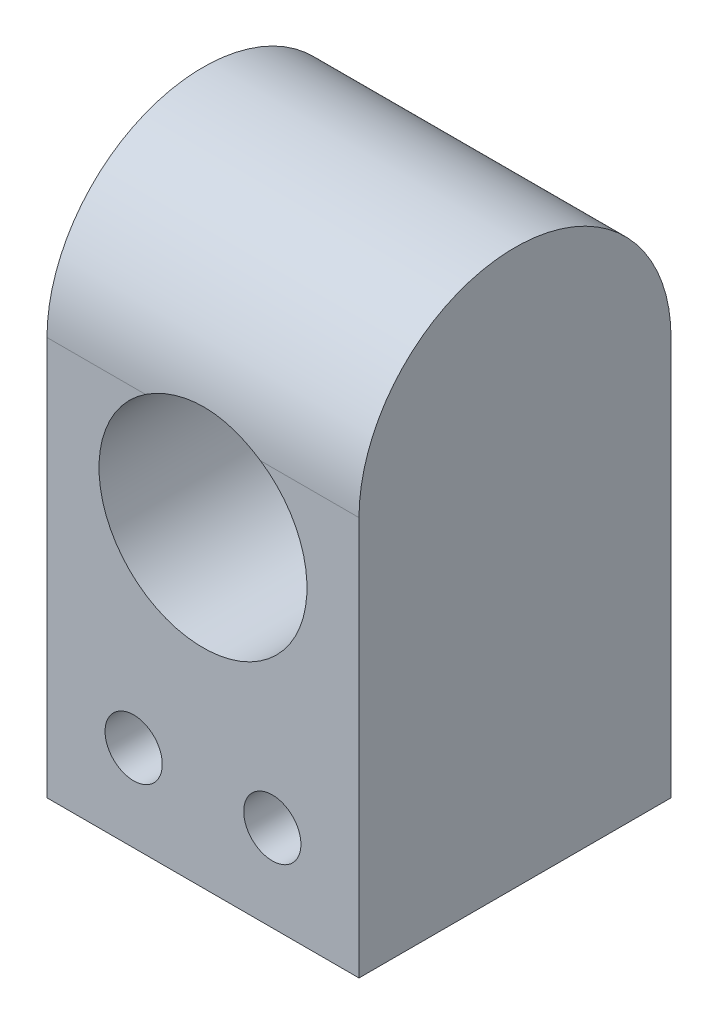
ISO-10303-21;
HEADER;
FILE_DESCRIPTION(('STEP AP214'),'2;1');
FILE_NAME('part.step','',(''),(''),'','','');
FILE_SCHEMA(('AUTOMOTIVE_DESIGN { 1 0 10303 214 1 1 1 1 }'));
ENDSEC;
DATA;
#1=APPLICATION_CONTEXT('core data for automotive mechanical design processes');
#2=APPLICATION_PROTOCOL_DEFINITION('international standard','automotive_design',2000,#1);
#3=PRODUCT_CONTEXT('',#1,'mechanical');
#4=PRODUCT('Part','Part','',(#3));
#5=PRODUCT_RELATED_PRODUCT_CATEGORY('part','',(#4));
#6=PRODUCT_DEFINITION_FORMATION('','',#4);
#7=PRODUCT_DEFINITION_CONTEXT('part definition',#1,'design');
#8=PRODUCT_DEFINITION('design','',#6,#7);
#9=PRODUCT_DEFINITION_SHAPE('','',#8);
#10=(LENGTH_UNIT() NAMED_UNIT(*) SI_UNIT(.MILLI.,.METRE.));
#11=(NAMED_UNIT(*) PLANE_ANGLE_UNIT() SI_UNIT($,.RADIAN.));
#12=(NAMED_UNIT(*) SI_UNIT($,.STERADIAN.) SOLID_ANGLE_UNIT());
#13=UNCERTAINTY_MEASURE_WITH_UNIT(LENGTH_MEASURE(1.E-05),#10,'distance_accuracy_value','');
#14=(GEOMETRIC_REPRESENTATION_CONTEXT(3) GLOBAL_UNCERTAINTY_ASSIGNED_CONTEXT((#13)) GLOBAL_UNIT_ASSIGNED_CONTEXT((#10,
#11,#12)) REPRESENTATION_CONTEXT('',''));
#15=CARTESIAN_POINT('',(0.,0.,0.));
#16=DIRECTION('',(0.,0.,1.));
#17=DIRECTION('',(1.,0.,0.));
#18=AXIS2_PLACEMENT_3D('',#15,#16,#17);
#19=CARTESIAN_POINT('',(18.,11.5,0.));
#20=DIRECTION('',(-1.,0.,0.));
#21=DIRECTION('',(0.,0.,1.));
#22=AXIS2_PLACEMENT_3D('',#19,#20,#21);
#23=CYLINDRICAL_SURFACE('',#22,9.);
#24=DIRECTION('',(-1.,0.,0.));
#25=VECTOR('',#24,1.);
#26=CARTESIAN_POINT('',(18.,11.5,-9.));
#27=LINE('',#26,#25);
#28=CARTESIAN_POINT('',(18.,11.5,-9.));
#29=VERTEX_POINT('',#28);
#30=CARTESIAN_POINT('',(12.3166247903554,11.5,-9.));
#31=VERTEX_POINT('',#30);
#32=EDGE_CURVE('E97',#29,#31,#27,.T.);
#33=ORIENTED_EDGE('',*,*,#32,.T.);
#34=CARTESIAN_POINT('',(12.3166247903554,11.5,-9.));
#35=CARTESIAN_POINT('',(12.1761745481952,11.5931857247578,-8.99998280686404));
#36=CARTESIAN_POINT('',(12.0317922057003,11.6804145747351,-8.99855170663781));
#37=CARTESIAN_POINT('',(11.7362436576243,11.8424064487936,-8.99385386357663));
#38=CARTESIAN_POINT('',(11.5850782346934,11.91717090638,-8.99058733202013));
#39=CARTESIAN_POINT('',(11.2770934608133,12.0536670923257,-8.98321231082458));
#40=CARTESIAN_POINT('',(11.1202771782546,12.1154057724005,-8.97910427260755));
#41=CARTESIAN_POINT('',(10.8020081921265,12.2254794431933,-8.97088254766373));
#42=CARTESIAN_POINT('',(10.6405554727502,12.273814388208,-8.96676886091772));
#43=CARTESIAN_POINT('',(10.3140870773853,12.3567525543189,-8.95922487573958));
#44=CARTESIAN_POINT('',(10.1490702362471,12.3913512109803,-8.9557948046545));
#45=CARTESIAN_POINT('',(9.8166910491816,12.4465448254244,-8.9501298620152));
#46=CARTESIAN_POINT('',(9.64932872217379,12.467139896099,-8.94789498082582));
#47=CARTESIAN_POINT('',(9.3134734590279,12.4941732408613,-8.94493181592674));
#48=CARTESIAN_POINT('',(9.1449806785411,12.5006134253665,-8.94420332890699));
#49=CARTESIAN_POINT('',(8.80805607207803,12.4992946764997,-8.94435076543655));
#50=CARTESIAN_POINT('',(8.63962424450806,12.4915361459604,-8.94522664346831));
#51=CARTESIAN_POINT('',(8.30449927814603,12.4619204707792,-8.94845959650483));
#52=CARTESIAN_POINT('',(8.13780257444923,12.440103168163,-8.95081248523224));
#53=CARTESIAN_POINT('',(7.80683097987093,12.3825644146765,-8.95666871348));
#54=CARTESIAN_POINT('',(7.64255632608802,12.34684161183,-8.9601721648598));
#55=CARTESIAN_POINT('',(7.3176976840931,12.2617734790637,-8.96780478435024));
#56=CARTESIAN_POINT('',(7.15711147776076,12.2124365816245,-8.97193356442457));
#57=CARTESIAN_POINT('',(6.8406941967366,12.1004958667899,-8.98011947678595));
#58=CARTESIAN_POINT('',(6.68486141124776,12.0378968885496,-8.98417663462359));
#59=CARTESIAN_POINT('',(6.38435800328011,11.9022785484094,-8.99125312525322));
#60=CARTESIAN_POINT('',(6.23948755800411,11.8297033713637,-8.99430395361245));
#61=CARTESIAN_POINT('',(5.95634049468018,11.6732289771663,-8.99866854537321));
#62=CARTESIAN_POINT('',(5.81805158792701,11.5893520824616,-8.99998567918921));
#63=CARTESIAN_POINT('',(5.6833752096446,11.5,-9.));
#64=B_SPLINE_CURVE_WITH_KNOTS('',3,(#34,#35,#36,#37,#38,#39,#40,#41,#42,#43,#44,#45,#46,#47,#48,
#49,#50,#51,#52,#53,#54,#55,#56,#57,#58,#59,#60,#61,#62,#63),.UNSPECIFIED.,.F.,.F.,(4,2,2,2,2,2,
2,2,2,2,2,2,2,2,4),(0.,0.505478352133196,1.01089853003349,1.5160482845355,2.02119976144932,
2.52651895507016,3.03183407494048,3.53708099064755,4.04231357217975,4.54612060348861,
5.04997663018364,5.55352126960013,6.05688248782416,6.54253134219247,7.02723466241762),.UNSPECIFIED.);
#65=CARTESIAN_POINT('',(5.6833752096446,11.5,-9.));
#66=VERTEX_POINT('',#65);
#67=EDGE_CURVE('E59',#31,#66,#64,.T.);
#68=ORIENTED_EDGE('',*,*,#67,.T.);
#69=CARTESIAN_POINT('',(0.,11.5,-9.));
#70=VERTEX_POINT('',#69);
#71=EDGE_CURVE('E94',#66,#70,#27,.T.);
#72=ORIENTED_EDGE('',*,*,#71,.T.);
#73=CARTESIAN_POINT('',(0.,11.5,0.));
#74=DIRECTION('',(1.,0.,0.));
#75=DIRECTION('',(0.,0.,1.));
#76=AXIS2_PLACEMENT_3D('',#73,#74,#75);
#77=CIRCLE('',#76,9.);
#78=CARTESIAN_POINT('',(0.,11.5,9.));
#79=VERTEX_POINT('',#78);
#80=EDGE_CURVE('E98',#70,#79,#77,.T.);
#81=ORIENTED_EDGE('',*,*,#80,.T.);
#82=DIRECTION('',(-1.,0.,0.));
#83=VECTOR('',#82,1.);
#84=CARTESIAN_POINT('',(18.,11.5,9.));
#85=LINE('',#84,#83);
#86=CARTESIAN_POINT('',(5.6833752096446,11.5,9.));
#87=VERTEX_POINT('',#86);
#88=EDGE_CURVE('E116',#87,#79,#85,.T.);
#89=ORIENTED_EDGE('',*,*,#88,.F.);
#90=CARTESIAN_POINT('',(5.6833752096446,11.5,9.));
#91=CARTESIAN_POINT('',(5.82382545180477,11.5931857247578,8.99998280686404));
#92=CARTESIAN_POINT('',(5.96820779429973,11.6804145747351,8.99855170663781));
#93=CARTESIAN_POINT('',(6.2637563423757,11.8424064487936,8.99385386357663));
#94=CARTESIAN_POINT('',(6.41492176530659,11.91717090638,8.99058733202014));
#95=CARTESIAN_POINT('',(6.72290653918665,12.0536670923257,8.98321231082459));
#96=CARTESIAN_POINT('',(6.87972282174541,12.1154057724005,8.97910427260756));
#97=CARTESIAN_POINT('',(7.19799180787347,12.2254794431933,8.97088254766373));
#98=CARTESIAN_POINT('',(7.35944452724977,12.273814388208,8.96676886091773));
#99=CARTESIAN_POINT('',(7.68591292261471,12.3567525543189,8.95922487573958));
#100=CARTESIAN_POINT('',(7.85092976375287,12.3913512109803,8.9557948046545));
#101=CARTESIAN_POINT('',(8.1833089508184,12.4465448254244,8.9501298620152));
#102=CARTESIAN_POINT('',(8.3506712778262,12.467139896099,8.94789498082582));
#103=CARTESIAN_POINT('',(8.68652654097209,12.4941732408613,8.94493181592675));
#104=CARTESIAN_POINT('',(8.85501932145889,12.5006134253665,8.94420332890699));
#105=CARTESIAN_POINT('',(9.19194392792196,12.4992946764997,8.94435076543656));
#106=CARTESIAN_POINT('',(9.36037575549194,12.4915361459604,8.94522664346831));
#107=CARTESIAN_POINT('',(9.69550072185396,12.4619204707792,8.94845959650483));
#108=CARTESIAN_POINT('',(9.86219742555076,12.440103168163,8.95081248523224));
#109=CARTESIAN_POINT('',(10.1931690201291,12.3825644146765,8.95666871348001));
#110=CARTESIAN_POINT('',(10.357443673912,12.34684161183,8.9601721648598));
#111=CARTESIAN_POINT('',(10.6823023159069,12.2617734790637,8.96780478435024));
#112=CARTESIAN_POINT('',(10.8428885222392,12.2124365816245,8.97193356442458));
#113=CARTESIAN_POINT('',(11.1593058032634,12.1004958667899,8.98011947678595));
#114=CARTESIAN_POINT('',(11.3151385887522,12.0378968885496,8.98417663462359));
#115=CARTESIAN_POINT('',(11.6156419967199,11.9022785484094,8.99125312525322));
#116=CARTESIAN_POINT('',(11.7605124419959,11.8297033713637,8.99430395361245));
#117=CARTESIAN_POINT('',(12.0436595053198,11.6732289771663,8.99866854537321));
#118=CARTESIAN_POINT('',(12.181948412073,11.5893520824616,8.99998567918922));
#119=CARTESIAN_POINT('',(12.3166247903554,11.5,9.));
#120=B_SPLINE_CURVE_WITH_KNOTS('',3,(#90,#91,#92,#93,#94,#95,#96,#97,#98,#99,#100,#101,#102,
#103,#104,#105,#106,#107,#108,#109,#110,#111,#112,#113,#114,#115,#116,#117,#118,#119),
.UNSPECIFIED.,.F.,.F.,(4,2,2,2,2,2,2,2,2,2,2,2,2,2,4),(0.,0.505478352133195,1.01089853003349,
1.5160482845355,2.02119976144932,2.52651895507016,3.03183407494048,3.53708099064754,
4.04231357217974,4.54612060348861,5.04997663018364,5.55352126960013,6.05688248782415,
6.54253134219247,7.02723466241762),.UNSPECIFIED.);
#121=CARTESIAN_POINT('',(12.3166247903554,11.5,9.));
#122=VERTEX_POINT('',#121);
#123=EDGE_CURVE('E52',#87,#122,#120,.T.);
#124=ORIENTED_EDGE('',*,*,#123,.T.);
#125=CARTESIAN_POINT('',(18.,11.5,9.));
#126=VERTEX_POINT('',#125);
#127=EDGE_CURVE('E46',#126,#122,#85,.T.);
#128=ORIENTED_EDGE('',*,*,#127,.F.);
#129=CARTESIAN_POINT('',(18.,11.5,0.));
#130=DIRECTION('',(1.,0.,0.));
#131=DIRECTION('',(0.,0.,1.));
#132=AXIS2_PLACEMENT_3D('',#129,#130,#131);
#133=CIRCLE('',#132,9.);
#134=EDGE_CURVE('E135',#29,#126,#133,.T.);
#135=ORIENTED_EDGE('',*,*,#134,.F.);
#136=EDGE_LOOP('',(#33,#68,#72,#81,#89,#124,#128,#135));
#137=FACE_BOUND('',#136,.T.);
#138=ADVANCED_FACE('F38',(#137),#23,.T.);
#139=CARTESIAN_POINT('',(18.,-11.5,9.));
#140=DIRECTION('',(0.,0.,-1.));
#141=DIRECTION('',(-1.,0.,0.));
#142=AXIS2_PLACEMENT_3D('',#139,#140,#141);
#143=PLANE('',#142);
#144=CARTESIAN_POINT('',(5.,-6.5,9.));
#145=DIRECTION('',(0.,0.,1.));
#146=DIRECTION('',(1.,0.,0.));
#147=AXIS2_PLACEMENT_3D('',#144,#145,#146);
#148=CIRCLE('',#147,1.64999999999999);
#149=CARTESIAN_POINT('',(6.64999999999999,-6.5,9.));
#150=VERTEX_POINT('',#149);
#151=EDGE_CURVE('E181',#150,#150,#148,.T.);
#152=ORIENTED_EDGE('',*,*,#151,.F.);
#153=EDGE_LOOP('',(#152));
#154=FACE_BOUND('',#153,.T.);
#155=CARTESIAN_POINT('',(13.,-6.5,9.));
#156=DIRECTION('',(0.,0.,1.));
#157=DIRECTION('',(1.,0.,0.));
#158=AXIS2_PLACEMENT_3D('',#155,#156,#157);
#159=CIRCLE('',#158,1.64999999999999);
#160=CARTESIAN_POINT('',(14.65,-6.5,9.));
#161=VERTEX_POINT('',#160);
#162=EDGE_CURVE('E184',#161,#161,#159,.T.);
#163=ORIENTED_EDGE('',*,*,#162,.F.);
#164=EDGE_LOOP('',(#163));
#165=FACE_BOUND('',#164,.T.);
#166=ORIENTED_EDGE('',*,*,#127,.T.);
#167=CARTESIAN_POINT('',(9.,6.5,9.));
#168=DIRECTION('',(0.,0.,1.));
#169=DIRECTION('',(1.,0.,0.));
#170=AXIS2_PLACEMENT_3D('',#167,#168,#169);
#171=CIRCLE('',#170,6.);
#172=EDGE_CURVE('E125',#87,#122,#171,.T.);
#173=ORIENTED_EDGE('',*,*,#172,.F.);
#174=ORIENTED_EDGE('',*,*,#88,.T.);
#175=DIRECTION('',(0.,-1.,0.));
#176=VECTOR('',#175,1.);
#177=CARTESIAN_POINT('',(0.,-11.5,9.));
#178=LINE('',#177,#176);
#179=CARTESIAN_POINT('',(0.,-11.5,9.));
#180=VERTEX_POINT('',#179);
#181=EDGE_CURVE('E124',#79,#180,#178,.T.);
#182=ORIENTED_EDGE('',*,*,#181,.T.);
#183=DIRECTION('',(-1.,0.,0.));
#184=VECTOR('',#183,1.);
#185=CARTESIAN_POINT('',(18.,-11.5,9.));
#186=LINE('',#185,#184);
#187=CARTESIAN_POINT('',(18.,-11.5,9.));
#188=VERTEX_POINT('',#187);
#189=EDGE_CURVE('E114',#188,#180,#186,.T.);
#190=ORIENTED_EDGE('',*,*,#189,.F.);
#191=DIRECTION('',(0.,-1.,0.));
#192=VECTOR('',#191,1.);
#193=CARTESIAN_POINT('',(18.,-11.5,9.));
#194=LINE('',#193,#192);
#195=EDGE_CURVE('E137',#126,#188,#194,.T.);
#196=ORIENTED_EDGE('',*,*,#195,.F.);
#197=EDGE_LOOP('',(#166,#173,#174,#182,#190,#196));
#198=FACE_BOUND('',#197,.T.);
#199=ADVANCED_FACE('F122',(#154,#165,#198),#143,.F.);
#200=CARTESIAN_POINT('',(18.,-11.5,9.));
#201=DIRECTION('',(0.,1.,0.));
#202=DIRECTION('',(0.,0.,1.));
#203=AXIS2_PLACEMENT_3D('',#200,#201,#202);
#204=PLANE('',#203);
#205=DIRECTION('',(0.,0.,-1.));
#206=VECTOR('',#205,1.);
#207=CARTESIAN_POINT('',(0.,-11.5,9.));
#208=LINE('',#207,#206);
#209=CARTESIAN_POINT('',(0.,-11.5,-9.));
#210=VERTEX_POINT('',#209);
#211=EDGE_CURVE('E129',#180,#210,#208,.T.);
#212=ORIENTED_EDGE('',*,*,#211,.T.);
#213=DIRECTION('',(-1.,0.,0.));
#214=VECTOR('',#213,1.);
#215=CARTESIAN_POINT('',(18.,-11.5,-9.));
#216=LINE('',#215,#214);
#217=CARTESIAN_POINT('',(18.,-11.5,-9.));
#218=VERTEX_POINT('',#217);
#219=EDGE_CURVE('E107',#218,#210,#216,.T.);
#220=ORIENTED_EDGE('',*,*,#219,.F.);
#221=DIRECTION('',(0.,0.,-1.));
#222=VECTOR('',#221,1.);
#223=CARTESIAN_POINT('',(18.,-11.5,9.));
#224=LINE('',#223,#222);
#225=EDGE_CURVE('E108',#188,#218,#224,.T.);
#226=ORIENTED_EDGE('',*,*,#225,.F.);
#227=ORIENTED_EDGE('',*,*,#189,.T.);
#228=EDGE_LOOP('',(#212,#220,#226,#227));
#229=FACE_BOUND('',#228,.T.);
#230=ADVANCED_FACE('F150',(#229),#204,.F.);
#231=CARTESIAN_POINT('',(18.,-11.5,-9.));
#232=DIRECTION('',(0.,0.,1.));
#233=DIRECTION('',(1.,0.,0.));
#234=AXIS2_PLACEMENT_3D('',#231,#232,#233);
#235=PLANE('',#234);
#236=CARTESIAN_POINT('',(5.,-6.5,-9.));
#237=DIRECTION('',(0.,0.,1.));
#238=DIRECTION('',(1.,0.,0.));
#239=AXIS2_PLACEMENT_3D('',#236,#237,#238);
#240=CIRCLE('',#239,1.64999999999998);
#241=CARTESIAN_POINT('',(6.64999999999999,-6.5,-9.));
#242=VERTEX_POINT('',#241);
#243=EDGE_CURVE('E186',#242,#242,#240,.T.);
#244=ORIENTED_EDGE('',*,*,#243,.T.);
#245=EDGE_LOOP('',(#244));
#246=FACE_BOUND('',#245,.T.);
#247=CARTESIAN_POINT('',(13.,-6.5,-9.));
#248=DIRECTION('',(0.,0.,1.));
#249=DIRECTION('',(1.,0.,0.));
#250=AXIS2_PLACEMENT_3D('',#247,#248,#249);
#251=CIRCLE('',#250,1.64999999999998);
#252=CARTESIAN_POINT('',(14.65,-6.5,-9.));
#253=VERTEX_POINT('',#252);
#254=EDGE_CURVE('E151',#253,#253,#251,.T.);
#255=ORIENTED_EDGE('',*,*,#254,.T.);
#256=EDGE_LOOP('',(#255));
#257=FACE_BOUND('',#256,.T.);
#258=ORIENTED_EDGE('',*,*,#71,.F.);
#259=CARTESIAN_POINT('',(9.,6.5,-9.));
#260=DIRECTION('',(0.,0.,1.));
#261=DIRECTION('',(1.,0.,0.));
#262=AXIS2_PLACEMENT_3D('',#259,#260,#261);
#263=CIRCLE('',#262,6.);
#264=EDGE_CURVE('E11',#66,#31,#263,.T.);
#265=ORIENTED_EDGE('',*,*,#264,.T.);
#266=ORIENTED_EDGE('',*,*,#32,.F.);
#267=DIRECTION('',(0.,1.,0.));
#268=VECTOR('',#267,1.);
#269=CARTESIAN_POINT('',(18.,-11.5,-9.));
#270=LINE('',#269,#268);
#271=EDGE_CURVE('E105',#218,#29,#270,.T.);
#272=ORIENTED_EDGE('',*,*,#271,.F.);
#273=ORIENTED_EDGE('',*,*,#219,.T.);
#274=DIRECTION('',(0.,1.,0.));
#275=VECTOR('',#274,1.);
#276=CARTESIAN_POINT('',(0.,-11.5,-9.));
#277=LINE('',#276,#275);
#278=EDGE_CURVE('E103',#210,#70,#277,.T.);
#279=ORIENTED_EDGE('',*,*,#278,.T.);
#280=EDGE_LOOP('',(#258,#265,#266,#272,#273,#279));
#281=FACE_BOUND('',#280,.T.);
#282=ADVANCED_FACE('F100',(#246,#257,#281),#235,.F.);
#283=CARTESIAN_POINT('',(18.,11.5,0.));
#284=DIRECTION('',(-1.,0.,0.));
#285=DIRECTION('',(0.,0.,1.));
#286=AXIS2_PLACEMENT_3D('',#283,#284,#285);
#287=PLANE('',#286);
#288=ORIENTED_EDGE('',*,*,#134,.T.);
#289=ORIENTED_EDGE('',*,*,#195,.T.);
#290=ORIENTED_EDGE('',*,*,#225,.T.);
#291=ORIENTED_EDGE('',*,*,#271,.T.);
#292=EDGE_LOOP('',(#288,#289,#290,#291));
#293=FACE_BOUND('',#292,.T.);
#294=ADVANCED_FACE('F148',(#293),#287,.F.);
#295=CARTESIAN_POINT('',(0.,11.5,0.));
#296=DIRECTION('',(-1.,0.,0.));
#297=DIRECTION('',(0.,0.,1.));
#298=AXIS2_PLACEMENT_3D('',#295,#296,#297);
#299=PLANE('',#298);
#300=ORIENTED_EDGE('',*,*,#80,.F.);
#301=ORIENTED_EDGE('',*,*,#278,.F.);
#302=ORIENTED_EDGE('',*,*,#211,.F.);
#303=ORIENTED_EDGE('',*,*,#181,.F.);
#304=EDGE_LOOP('',(#300,#301,#302,#303));
#305=FACE_BOUND('',#304,.T.);
#306=ADVANCED_FACE('F128',(#305),#299,.T.);
#307=CARTESIAN_POINT('',(9.,6.5,-9.));
#308=DIRECTION('',(0.,0.,1.));
#309=DIRECTION('',(1.,0.,0.));
#310=AXIS2_PLACEMENT_3D('',#307,#308,#309);
#311=CYLINDRICAL_SURFACE('',#310,6.);
#312=ORIENTED_EDGE('',*,*,#172,.T.);
#313=ORIENTED_EDGE('',*,*,#123,.F.);
#314=EDGE_LOOP('',(#312,#313));
#315=FACE_BOUND('',#314,.T.);
#316=ORIENTED_EDGE('',*,*,#264,.F.);
#317=ORIENTED_EDGE('',*,*,#67,.F.);
#318=EDGE_LOOP('',(#316,#317));
#319=FACE_BOUND('',#318,.T.);
#320=ADVANCED_FACE('F87',(#315,#319),#311,.F.);
#321=CARTESIAN_POINT('',(13.,-6.5,9.));
#322=DIRECTION('',(0.,0.,1.));
#323=DIRECTION('',(1.,0.,0.));
#324=AXIS2_PLACEMENT_3D('',#321,#322,#323);
#325=CYLINDRICAL_SURFACE('',#324,1.64999999999999);
#326=ORIENTED_EDGE('',*,*,#254,.F.);
#327=EDGE_LOOP('',(#326));
#328=FACE_BOUND('',#327,.T.);
#329=ORIENTED_EDGE('',*,*,#162,.T.);
#330=EDGE_LOOP('',(#329));
#331=FACE_BOUND('',#330,.T.);
#332=ADVANCED_FACE('F162',(#328,#331),#325,.F.);
#333=CARTESIAN_POINT('',(5.,-6.5,9.));
#334=DIRECTION('',(0.,0.,1.));
#335=DIRECTION('',(1.,0.,0.));
#336=AXIS2_PLACEMENT_3D('',#333,#334,#335);
#337=CYLINDRICAL_SURFACE('',#336,1.64999999999999);
#338=ORIENTED_EDGE('',*,*,#243,.F.);
#339=EDGE_LOOP('',(#338));
#340=FACE_BOUND('',#339,.T.);
#341=ORIENTED_EDGE('',*,*,#151,.T.);
#342=EDGE_LOOP('',(#341));
#343=FACE_BOUND('',#342,.T.);
#344=ADVANCED_FACE('F193',(#340,#343),#337,.F.);
#345=CLOSED_SHELL('',(#138,#199,#230,#282,#294,#306,#320,#332,#344));
#346=MANIFOLD_SOLID_BREP('B2',#345);
#347=ADVANCED_BREP_SHAPE_REPRESENTATION('',(#18,#346),#14);
#348=SHAPE_DEFINITION_REPRESENTATION(#9,#347);
ENDSEC;
END-ISO-10303-21;
